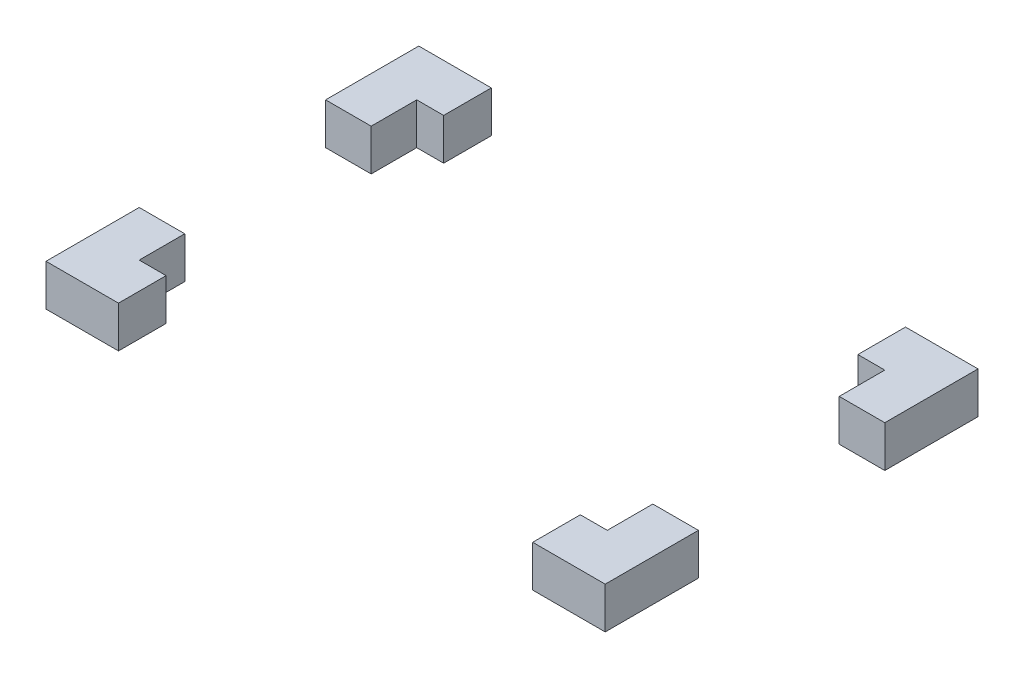
ISO-10303-21;
HEADER;
FILE_DESCRIPTION(('STEP AP214'),'2;1');
FILE_NAME('part.step','',(''),(''),'','','');
FILE_SCHEMA(('AUTOMOTIVE_DESIGN { 1 0 10303 214 1 1 1 1 }'));
ENDSEC;
DATA;
#1=APPLICATION_CONTEXT('core data for automotive mechanical design processes');
#2=APPLICATION_PROTOCOL_DEFINITION('international standard','automotive_design',2000,#1);
#3=PRODUCT_CONTEXT('',#1,'mechanical');
#4=PRODUCT('Part','Part','',(#3));
#5=PRODUCT_RELATED_PRODUCT_CATEGORY('part','',(#4));
#6=PRODUCT_DEFINITION_FORMATION('','',#4);
#7=PRODUCT_DEFINITION_CONTEXT('part definition',#1,'design');
#8=PRODUCT_DEFINITION('design','',#6,#7);
#9=PRODUCT_DEFINITION_SHAPE('','',#8);
#10=(LENGTH_UNIT() NAMED_UNIT(*) SI_UNIT(.MILLI.,.METRE.));
#11=(NAMED_UNIT(*) PLANE_ANGLE_UNIT() SI_UNIT($,.RADIAN.));
#12=(NAMED_UNIT(*) SI_UNIT($,.STERADIAN.) SOLID_ANGLE_UNIT());
#13=UNCERTAINTY_MEASURE_WITH_UNIT(LENGTH_MEASURE(1.E-05),#10,'distance_accuracy_value','');
#14=(GEOMETRIC_REPRESENTATION_CONTEXT(3) GLOBAL_UNCERTAINTY_ASSIGNED_CONTEXT((#13)) GLOBAL_UNIT_ASSIGNED_CONTEXT((#10,
#11,#12)) REPRESENTATION_CONTEXT('',''));
#15=CARTESIAN_POINT('',(0.,0.,0.));
#16=DIRECTION('',(0.,0.,1.));
#17=DIRECTION('',(1.,0.,0.));
#18=AXIS2_PLACEMENT_3D('',#15,#16,#17);
#19=CARTESIAN_POINT('',(-67.5,10.,45.));
#20=DIRECTION('',(0.,0.,-1.));
#21=DIRECTION('',(-1.,0.,0.));
#22=AXIS2_PLACEMENT_3D('',#19,#20,#21);
#23=PLANE('',#22);
#24=DIRECTION('',(1.,0.,0.));
#25=VECTOR('',#24,1.);
#26=CARTESIAN_POINT('',(-67.5,0.,45.));
#27=LINE('',#26,#25);
#28=CARTESIAN_POINT('',(-67.5,0.,45.));
#29=VERTEX_POINT('',#28);
#30=CARTESIAN_POINT('',(-50.,0.,45.));
#31=VERTEX_POINT('',#30);
#32=EDGE_CURVE('E110',#29,#31,#27,.T.);
#33=ORIENTED_EDGE('',*,*,#32,.T.);
#34=DIRECTION('',(0.,1.,0.));
#35=VECTOR('',#34,1.);
#36=CARTESIAN_POINT('',(-50.,10.,45.));
#37=LINE('',#36,#35);
#38=CARTESIAN_POINT('',(-50.,10.,45.));
#39=VERTEX_POINT('',#38);
#40=EDGE_CURVE('E98',#31,#39,#37,.T.);
#41=ORIENTED_EDGE('',*,*,#40,.T.);
#42=DIRECTION('',(1.,0.,0.));
#43=VECTOR('',#42,1.);
#44=CARTESIAN_POINT('',(-67.5,10.,45.));
#45=LINE('',#44,#43);
#46=CARTESIAN_POINT('',(-67.5,10.,45.));
#47=VERTEX_POINT('',#46);
#48=EDGE_CURVE('E107',#47,#39,#45,.T.);
#49=ORIENTED_EDGE('',*,*,#48,.F.);
#50=DIRECTION('',(0.,-1.,0.));
#51=VECTOR('',#50,1.);
#52=CARTESIAN_POINT('',(-67.5,10.,45.));
#53=LINE('',#52,#51);
#54=EDGE_CURVE('E111',#47,#29,#53,.T.);
#55=ORIENTED_EDGE('',*,*,#54,.T.);
#56=EDGE_LOOP('',(#33,#41,#49,#55));
#57=FACE_BOUND('',#56,.T.);
#58=ADVANCED_FACE('F49',(#57),#23,.F.);
#59=CARTESIAN_POINT('',(-56.5,10.,33.5));
#60=DIRECTION('',(0.,0.,-1.));
#61=DIRECTION('',(-1.,0.,0.));
#62=AXIS2_PLACEMENT_3D('',#59,#60,#61);
#63=PLANE('',#62);
#64=DIRECTION('',(0.,1.,0.));
#65=VECTOR('',#64,1.);
#66=CARTESIAN_POINT('',(-50.,10.,33.5));
#67=LINE('',#66,#65);
#68=CARTESIAN_POINT('',(-50.,0.,33.5));
#69=VERTEX_POINT('',#68);
#70=CARTESIAN_POINT('',(-50.,10.,33.5));
#71=VERTEX_POINT('',#70);
#72=EDGE_CURVE('E58',#69,#71,#67,.T.);
#73=ORIENTED_EDGE('',*,*,#72,.F.);
#74=DIRECTION('',(1.,0.,0.));
#75=VECTOR('',#74,1.);
#76=CARTESIAN_POINT('',(-56.5,0.,33.5));
#77=LINE('',#76,#75);
#78=CARTESIAN_POINT('',(-56.5,0.,33.5));
#79=VERTEX_POINT('',#78);
#80=EDGE_CURVE('E128',#79,#69,#77,.T.);
#81=ORIENTED_EDGE('',*,*,#80,.F.);
#82=DIRECTION('',(0.,-1.,0.));
#83=VECTOR('',#82,1.);
#84=CARTESIAN_POINT('',(-56.5,10.,33.5));
#85=LINE('',#84,#83);
#86=CARTESIAN_POINT('',(-56.5,10.,33.5));
#87=VERTEX_POINT('',#86);
#88=EDGE_CURVE('E119',#87,#79,#85,.T.);
#89=ORIENTED_EDGE('',*,*,#88,.F.);
#90=DIRECTION('',(1.,0.,0.));
#91=VECTOR('',#90,1.);
#92=CARTESIAN_POINT('',(-56.5,10.,33.5));
#93=LINE('',#92,#91);
#94=EDGE_CURVE('E126',#87,#71,#93,.T.);
#95=ORIENTED_EDGE('',*,*,#94,.T.);
#96=EDGE_LOOP('',(#73,#81,#89,#95));
#97=FACE_BOUND('',#96,.T.);
#98=ADVANCED_FACE('F157',(#97),#63,.T.);
#99=CARTESIAN_POINT('',(0.,0.,0.));
#100=DIRECTION('',(0.,1.,0.));
#101=DIRECTION('',(0.,0.,1.));
#102=AXIS2_PLACEMENT_3D('',#99,#100,#101);
#103=PLANE('',#102);
#104=ORIENTED_EDGE('',*,*,#80,.T.);
#105=DIRECTION('',(0.,0.,1.));
#106=VECTOR('',#105,1.);
#107=CARTESIAN_POINT('',(-50.,0.,0.));
#108=LINE('',#107,#106);
#109=EDGE_CURVE('E66',#69,#31,#108,.T.);
#110=ORIENTED_EDGE('',*,*,#109,.T.);
#111=ORIENTED_EDGE('',*,*,#32,.F.);
#112=DIRECTION('',(0.,0.,1.));
#113=VECTOR('',#112,1.);
#114=CARTESIAN_POINT('',(-67.5,0.,-45.));
#115=LINE('',#114,#113);
#116=CARTESIAN_POINT('',(-67.5,0.,22.5));
#117=VERTEX_POINT('',#116);
#118=EDGE_CURVE('E132',#117,#29,#115,.T.);
#119=ORIENTED_EDGE('',*,*,#118,.F.);
#120=DIRECTION('',(1.,0.,0.));
#121=VECTOR('',#120,1.);
#122=CARTESIAN_POINT('',(0.,0.,22.5));
#123=LINE('',#122,#121);
#124=CARTESIAN_POINT('',(-56.5,0.,22.5));
#125=VERTEX_POINT('',#124);
#126=EDGE_CURVE('E52',#117,#125,#123,.T.);
#127=ORIENTED_EDGE('',*,*,#126,.T.);
#128=DIRECTION('',(0.,0.,1.));
#129=VECTOR('',#128,1.);
#130=CARTESIAN_POINT('',(-56.5,0.,-33.5));
#131=LINE('',#130,#129);
#132=EDGE_CURVE('E121',#125,#79,#131,.T.);
#133=ORIENTED_EDGE('',*,*,#132,.T.);
#134=EDGE_LOOP('',(#104,#110,#111,#119,#127,#133));
#135=FACE_BOUND('',#134,.T.);
#136=ADVANCED_FACE('F150',(#135),#103,.F.);
#137=CARTESIAN_POINT('',(0.,10.,0.));
#138=DIRECTION('',(0.,1.,0.));
#139=DIRECTION('',(0.,0.,1.));
#140=AXIS2_PLACEMENT_3D('',#137,#138,#139);
#141=PLANE('',#140);
#142=DIRECTION('',(0.,0.,1.));
#143=VECTOR('',#142,1.);
#144=CARTESIAN_POINT('',(-50.,10.,0.));
#145=LINE('',#144,#143);
#146=EDGE_CURVE('E12',#71,#39,#145,.T.);
#147=ORIENTED_EDGE('',*,*,#146,.F.);
#148=ORIENTED_EDGE('',*,*,#94,.F.);
#149=DIRECTION('',(0.,0.,1.));
#150=VECTOR('',#149,1.);
#151=CARTESIAN_POINT('',(-56.5,10.,-33.5));
#152=LINE('',#151,#150);
#153=CARTESIAN_POINT('',(-56.5,10.,22.5));
#154=VERTEX_POINT('',#153);
#155=EDGE_CURVE('E117',#154,#87,#152,.T.);
#156=ORIENTED_EDGE('',*,*,#155,.F.);
#157=DIRECTION('',(1.,0.,0.));
#158=VECTOR('',#157,1.);
#159=CARTESIAN_POINT('',(0.,10.,22.5));
#160=LINE('',#159,#158);
#161=CARTESIAN_POINT('',(-67.5,10.,22.5));
#162=VERTEX_POINT('',#161);
#163=EDGE_CURVE('E130',#162,#154,#160,.T.);
#164=ORIENTED_EDGE('',*,*,#163,.F.);
#165=DIRECTION('',(0.,0.,1.));
#166=VECTOR('',#165,1.);
#167=CARTESIAN_POINT('',(-67.5,10.,-45.));
#168=LINE('',#167,#166);
#169=EDGE_CURVE('E116',#162,#47,#168,.T.);
#170=ORIENTED_EDGE('',*,*,#169,.T.);
#171=ORIENTED_EDGE('',*,*,#48,.T.);
#172=EDGE_LOOP('',(#147,#148,#156,#164,#170,#171));
#173=FACE_BOUND('',#172,.T.);
#174=ADVANCED_FACE('F113',(#173),#141,.T.);
#175=CARTESIAN_POINT('',(-56.5,10.,-33.5));
#176=DIRECTION('',(1.,0.,0.));
#177=DIRECTION('',(0.,0.,-1.));
#178=AXIS2_PLACEMENT_3D('',#175,#176,#177);
#179=PLANE('',#178);
#180=DIRECTION('',(0.,-1.,0.));
#181=VECTOR('',#180,1.);
#182=CARTESIAN_POINT('',(-56.5,10.,22.5));
#183=LINE('',#182,#181);
#184=EDGE_CURVE('E131',#154,#125,#183,.T.);
#185=ORIENTED_EDGE('',*,*,#184,.F.);
#186=ORIENTED_EDGE('',*,*,#155,.T.);
#187=ORIENTED_EDGE('',*,*,#88,.T.);
#188=ORIENTED_EDGE('',*,*,#132,.F.);
#189=EDGE_LOOP('',(#185,#186,#187,#188));
#190=FACE_BOUND('',#189,.T.);
#191=ADVANCED_FACE('F153',(#190),#179,.T.);
#192=CARTESIAN_POINT('',(-67.5,10.,-45.));
#193=DIRECTION('',(1.,0.,0.));
#194=DIRECTION('',(0.,0.,-1.));
#195=AXIS2_PLACEMENT_3D('',#192,#193,#194);
#196=PLANE('',#195);
#197=ORIENTED_EDGE('',*,*,#169,.F.);
#198=DIRECTION('',(0.,-1.,0.));
#199=VECTOR('',#198,1.);
#200=CARTESIAN_POINT('',(-67.5,10.,22.5));
#201=LINE('',#200,#199);
#202=EDGE_CURVE('E136',#162,#117,#201,.T.);
#203=ORIENTED_EDGE('',*,*,#202,.T.);
#204=ORIENTED_EDGE('',*,*,#118,.T.);
#205=ORIENTED_EDGE('',*,*,#54,.F.);
#206=EDGE_LOOP('',(#197,#203,#204,#205));
#207=FACE_BOUND('',#206,.T.);
#208=ADVANCED_FACE('F158',(#207),#196,.F.);
#209=CARTESIAN_POINT('',(356.5,15.,22.5));
#210=DIRECTION('',(0.,0.,1.));
#211=DIRECTION('',(0.,-1.,0.));
#212=AXIS2_PLACEMENT_3D('',#209,#210,#211);
#213=PLANE('',#212);
#214=ORIENTED_EDGE('',*,*,#163,.T.);
#215=ORIENTED_EDGE('',*,*,#184,.T.);
#216=ORIENTED_EDGE('',*,*,#126,.F.);
#217=ORIENTED_EDGE('',*,*,#202,.F.);
#218=EDGE_LOOP('',(#214,#215,#216,#217));
#219=FACE_BOUND('',#218,.T.);
#220=ADVANCED_FACE('F159',(#219),#213,.F.);
#221=CARTESIAN_POINT('',(-50.,-15.,-58.8496360731405));
#222=DIRECTION('',(-1.,0.,0.));
#223=DIRECTION('',(0.,0.,1.));
#224=AXIS2_PLACEMENT_3D('',#221,#222,#223);
#225=PLANE('',#224);
#226=ORIENTED_EDGE('',*,*,#72,.T.);
#227=ORIENTED_EDGE('',*,*,#146,.T.);
#228=ORIENTED_EDGE('',*,*,#40,.F.);
#229=ORIENTED_EDGE('',*,*,#109,.F.);
#230=EDGE_LOOP('',(#226,#227,#228,#229));
#231=FACE_BOUND('',#230,.T.);
#232=ADVANCED_FACE('F97',(#231),#225,.F.);
#233=CLOSED_SHELL('',(#58,#98,#136,#174,#191,#208,#220,#232));
#234=MANIFOLD_SOLID_BREP('B2',#233);
#235=CARTESIAN_POINT('',(0.,10.,0.));
#236=DIRECTION('',(0.,1.,0.));
#237=DIRECTION('',(0.,0.,1.));
#238=AXIS2_PLACEMENT_3D('',#235,#236,#237);
#239=PLANE('',#238);
#240=DIRECTION('',(0.,0.,1.));
#241=VECTOR('',#240,1.);
#242=CARTESIAN_POINT('',(-50.,10.,0.));
#243=LINE('',#242,#241);
#244=CARTESIAN_POINT('',(-50.,10.,-45.));
#245=VERTEX_POINT('',#244);
#246=CARTESIAN_POINT('',(-50.,10.,-33.5));
#247=VERTEX_POINT('',#246);
#248=EDGE_CURVE('E243',#245,#247,#243,.T.);
#249=ORIENTED_EDGE('',*,*,#248,.F.);
#250=DIRECTION('',(-1.,0.,0.));
#251=VECTOR('',#250,1.);
#252=CARTESIAN_POINT('',(-67.5,10.,-45.));
#253=LINE('',#252,#251);
#254=CARTESIAN_POINT('',(-67.5,10.,-45.));
#255=VERTEX_POINT('',#254);
#256=EDGE_CURVE('E237',#245,#255,#253,.T.);
#257=ORIENTED_EDGE('',*,*,#256,.T.);
#258=DIRECTION('',(0.,0.,1.));
#259=VECTOR('',#258,1.);
#260=CARTESIAN_POINT('',(-67.5,10.,-45.));
#261=LINE('',#260,#259);
#262=CARTESIAN_POINT('',(-67.5,10.,-22.5));
#263=VERTEX_POINT('',#262);
#264=EDGE_CURVE('E295',#255,#263,#261,.T.);
#265=ORIENTED_EDGE('',*,*,#264,.T.);
#266=DIRECTION('',(-1.,0.,0.));
#267=VECTOR('',#266,1.);
#268=CARTESIAN_POINT('',(0.,10.,-22.5));
#269=LINE('',#268,#267);
#270=CARTESIAN_POINT('',(-56.5,10.,-22.5));
#271=VERTEX_POINT('',#270);
#272=EDGE_CURVE('E317',#271,#263,#269,.T.);
#273=ORIENTED_EDGE('',*,*,#272,.F.);
#274=DIRECTION('',(0.,0.,1.));
#275=VECTOR('',#274,1.);
#276=CARTESIAN_POINT('',(-56.5,10.,-33.5));
#277=LINE('',#276,#275);
#278=CARTESIAN_POINT('',(-56.5,10.,-33.5));
#279=VERTEX_POINT('',#278);
#280=EDGE_CURVE('E327',#279,#271,#277,.T.);
#281=ORIENTED_EDGE('',*,*,#280,.F.);
#282=DIRECTION('',(-1.,0.,0.));
#283=VECTOR('',#282,1.);
#284=CARTESIAN_POINT('',(-56.5,10.,-33.5));
#285=LINE('',#284,#283);
#286=EDGE_CURVE('E312',#247,#279,#285,.T.);
#287=ORIENTED_EDGE('',*,*,#286,.F.);
#288=EDGE_LOOP('',(#249,#257,#265,#273,#281,#287));
#289=FACE_BOUND('',#288,.T.);
#290=ADVANCED_FACE('F234',(#289),#239,.T.);
#291=CARTESIAN_POINT('',(0.,0.,0.));
#292=DIRECTION('',(0.,1.,0.));
#293=DIRECTION('',(0.,0.,1.));
#294=AXIS2_PLACEMENT_3D('',#291,#292,#293);
#295=PLANE('',#294);
#296=DIRECTION('',(-1.,0.,0.));
#297=VECTOR('',#296,1.);
#298=CARTESIAN_POINT('',(-67.5,0.,-45.));
#299=LINE('',#298,#297);
#300=CARTESIAN_POINT('',(-50.,0.,-45.));
#301=VERTEX_POINT('',#300);
#302=CARTESIAN_POINT('',(-67.5,0.,-45.));
#303=VERTEX_POINT('',#302);
#304=EDGE_CURVE('E294',#301,#303,#299,.T.);
#305=ORIENTED_EDGE('',*,*,#304,.F.);
#306=DIRECTION('',(0.,0.,1.));
#307=VECTOR('',#306,1.);
#308=CARTESIAN_POINT('',(-50.,0.,0.));
#309=LINE('',#308,#307);
#310=CARTESIAN_POINT('',(-50.,0.,-33.5));
#311=VERTEX_POINT('',#310);
#312=EDGE_CURVE('E283',#301,#311,#309,.T.);
#313=ORIENTED_EDGE('',*,*,#312,.T.);
#314=DIRECTION('',(-1.,0.,0.));
#315=VECTOR('',#314,1.);
#316=CARTESIAN_POINT('',(-56.5,0.,-33.5));
#317=LINE('',#316,#315);
#318=CARTESIAN_POINT('',(-56.5,0.,-33.5));
#319=VERTEX_POINT('',#318);
#320=EDGE_CURVE('E291',#311,#319,#317,.T.);
#321=ORIENTED_EDGE('',*,*,#320,.T.);
#322=DIRECTION('',(0.,0.,1.));
#323=VECTOR('',#322,1.);
#324=CARTESIAN_POINT('',(-56.5,0.,-33.5));
#325=LINE('',#324,#323);
#326=CARTESIAN_POINT('',(-56.5,0.,-22.5));
#327=VERTEX_POINT('',#326);
#328=EDGE_CURVE('E301',#319,#327,#325,.T.);
#329=ORIENTED_EDGE('',*,*,#328,.T.);
#330=DIRECTION('',(-1.,0.,0.));
#331=VECTOR('',#330,1.);
#332=CARTESIAN_POINT('',(0.,0.,-22.5));
#333=LINE('',#332,#331);
#334=CARTESIAN_POINT('',(-67.5,0.,-22.5));
#335=VERTEX_POINT('',#334);
#336=EDGE_CURVE('E303',#327,#335,#333,.T.);
#337=ORIENTED_EDGE('',*,*,#336,.T.);
#338=DIRECTION('',(0.,0.,1.));
#339=VECTOR('',#338,1.);
#340=CARTESIAN_POINT('',(-67.5,0.,-45.));
#341=LINE('',#340,#339);
#342=EDGE_CURVE('E320',#303,#335,#341,.T.);
#343=ORIENTED_EDGE('',*,*,#342,.F.);
#344=EDGE_LOOP('',(#305,#313,#321,#329,#337,#343));
#345=FACE_BOUND('',#344,.T.);
#346=ADVANCED_FACE('F289',(#345),#295,.F.);
#347=CARTESIAN_POINT('',(-67.5,10.,-45.));
#348=DIRECTION('',(0.,0.,1.));
#349=DIRECTION('',(1.,0.,0.));
#350=AXIS2_PLACEMENT_3D('',#347,#348,#349);
#351=PLANE('',#350);
#352=ORIENTED_EDGE('',*,*,#256,.F.);
#353=DIRECTION('',(0.,-1.,0.));
#354=VECTOR('',#353,1.);
#355=CARTESIAN_POINT('',(-50.,10.,-45.));
#356=LINE('',#355,#354);
#357=EDGE_CURVE('E252',#245,#301,#356,.T.);
#358=ORIENTED_EDGE('',*,*,#357,.T.);
#359=ORIENTED_EDGE('',*,*,#304,.T.);
#360=DIRECTION('',(0.,-1.,0.));
#361=VECTOR('',#360,1.);
#362=CARTESIAN_POINT('',(-67.5,10.,-45.));
#363=LINE('',#362,#361);
#364=EDGE_CURVE('E315',#255,#303,#363,.T.);
#365=ORIENTED_EDGE('',*,*,#364,.F.);
#366=EDGE_LOOP('',(#352,#358,#359,#365));
#367=FACE_BOUND('',#366,.T.);
#368=ADVANCED_FACE('F339',(#367),#351,.F.);
#369=CARTESIAN_POINT('',(-56.5,10.,-33.5));
#370=DIRECTION('',(0.,0.,1.));
#371=DIRECTION('',(1.,0.,0.));
#372=AXIS2_PLACEMENT_3D('',#369,#370,#371);
#373=PLANE('',#372);
#374=DIRECTION('',(0.,-1.,0.));
#375=VECTOR('',#374,1.);
#376=CARTESIAN_POINT('',(-50.,10.,-33.5));
#377=LINE('',#376,#375);
#378=EDGE_CURVE('E47',#247,#311,#377,.T.);
#379=ORIENTED_EDGE('',*,*,#378,.F.);
#380=ORIENTED_EDGE('',*,*,#286,.T.);
#381=DIRECTION('',(0.,-1.,0.));
#382=VECTOR('',#381,1.);
#383=CARTESIAN_POINT('',(-56.5,10.,-33.5));
#384=LINE('',#383,#382);
#385=EDGE_CURVE('E300',#279,#319,#384,.T.);
#386=ORIENTED_EDGE('',*,*,#385,.T.);
#387=ORIENTED_EDGE('',*,*,#320,.F.);
#388=EDGE_LOOP('',(#379,#380,#386,#387));
#389=FACE_BOUND('',#388,.T.);
#390=ADVANCED_FACE('F298',(#389),#373,.T.);
#391=CARTESIAN_POINT('',(-67.5,10.,-45.));
#392=DIRECTION('',(1.,0.,0.));
#393=DIRECTION('',(0.,0.,-1.));
#394=AXIS2_PLACEMENT_3D('',#391,#392,#393);
#395=PLANE('',#394);
#396=ORIENTED_EDGE('',*,*,#342,.T.);
#397=DIRECTION('',(0.,1.,0.));
#398=VECTOR('',#397,1.);
#399=CARTESIAN_POINT('',(-67.5,10.,-22.5));
#400=LINE('',#399,#398);
#401=EDGE_CURVE('E321',#335,#263,#400,.T.);
#402=ORIENTED_EDGE('',*,*,#401,.T.);
#403=ORIENTED_EDGE('',*,*,#264,.F.);
#404=ORIENTED_EDGE('',*,*,#364,.T.);
#405=EDGE_LOOP('',(#396,#402,#403,#404));
#406=FACE_BOUND('',#405,.T.);
#407=ADVANCED_FACE('F338',(#406),#395,.F.);
#408=CARTESIAN_POINT('',(-56.5,10.,-33.5));
#409=DIRECTION('',(1.,0.,0.));
#410=DIRECTION('',(0.,0.,-1.));
#411=AXIS2_PLACEMENT_3D('',#408,#409,#410);
#412=PLANE('',#411);
#413=DIRECTION('',(0.,1.,0.));
#414=VECTOR('',#413,1.);
#415=CARTESIAN_POINT('',(-56.5,10.,-22.5));
#416=LINE('',#415,#414);
#417=EDGE_CURVE('E319',#327,#271,#416,.T.);
#418=ORIENTED_EDGE('',*,*,#417,.F.);
#419=ORIENTED_EDGE('',*,*,#328,.F.);
#420=ORIENTED_EDGE('',*,*,#385,.F.);
#421=ORIENTED_EDGE('',*,*,#280,.T.);
#422=EDGE_LOOP('',(#418,#419,#420,#421));
#423=FACE_BOUND('',#422,.T.);
#424=ADVANCED_FACE('F344',(#423),#412,.T.);
#425=CARTESIAN_POINT('',(356.5,15.,-22.5));
#426=DIRECTION('',(0.,0.,-1.));
#427=DIRECTION('',(0.,1.,0.));
#428=AXIS2_PLACEMENT_3D('',#425,#426,#427);
#429=PLANE('',#428);
#430=ORIENTED_EDGE('',*,*,#336,.F.);
#431=ORIENTED_EDGE('',*,*,#417,.T.);
#432=ORIENTED_EDGE('',*,*,#272,.T.);
#433=ORIENTED_EDGE('',*,*,#401,.F.);
#434=EDGE_LOOP('',(#430,#431,#432,#433));
#435=FACE_BOUND('',#434,.T.);
#436=ADVANCED_FACE('F343',(#435),#429,.F.);
#437=CARTESIAN_POINT('',(-50.,-15.,-58.8496360731405));
#438=DIRECTION('',(-1.,0.,0.));
#439=DIRECTION('',(0.,0.,1.));
#440=AXIS2_PLACEMENT_3D('',#437,#438,#439);
#441=PLANE('',#440);
#442=ORIENTED_EDGE('',*,*,#248,.T.);
#443=ORIENTED_EDGE('',*,*,#378,.T.);
#444=ORIENTED_EDGE('',*,*,#312,.F.);
#445=ORIENTED_EDGE('',*,*,#357,.F.);
#446=EDGE_LOOP('',(#442,#443,#444,#445));
#447=FACE_BOUND('',#446,.T.);
#448=ADVANCED_FACE('F282',(#447),#441,.F.);
#449=CLOSED_SHELL('',(#290,#346,#368,#390,#407,#424,#436,#448));
#450=MANIFOLD_SOLID_BREP('B6',#449);
#451=CARTESIAN_POINT('',(356.5,15.,-22.5));
#452=DIRECTION('',(0.,0.,-1.));
#453=DIRECTION('',(0.,1.,0.));
#454=AXIS2_PLACEMENT_3D('',#451,#452,#453);
#455=PLANE('',#454);
#456=DIRECTION('',(-1.,0.,0.));
#457=VECTOR('',#456,1.);
#458=CARTESIAN_POINT('',(0.,10.,-22.5));
#459=LINE('',#458,#457);
#460=CARTESIAN_POINT('',(67.5,10.,-22.5));
#461=VERTEX_POINT('',#460);
#462=CARTESIAN_POINT('',(56.5,10.,-22.5));
#463=VERTEX_POINT('',#462);
#464=EDGE_CURVE('E454',#461,#463,#459,.T.);
#465=ORIENTED_EDGE('',*,*,#464,.T.);
#466=DIRECTION('',(0.,-1.,0.));
#467=VECTOR('',#466,1.);
#468=CARTESIAN_POINT('',(56.5,10.,-22.5));
#469=LINE('',#468,#467);
#470=CARTESIAN_POINT('',(56.5,0.,-22.5));
#471=VERTEX_POINT('',#470);
#472=EDGE_CURVE('E426',#463,#471,#469,.T.);
#473=ORIENTED_EDGE('',*,*,#472,.T.);
#474=DIRECTION('',(-1.,0.,0.));
#475=VECTOR('',#474,1.);
#476=CARTESIAN_POINT('',(0.,0.,-22.5));
#477=LINE('',#476,#475);
#478=CARTESIAN_POINT('',(67.5,0.,-22.5));
#479=VERTEX_POINT('',#478);
#480=EDGE_CURVE('E506',#479,#471,#477,.T.);
#481=ORIENTED_EDGE('',*,*,#480,.F.);
#482=DIRECTION('',(0.,-1.,0.));
#483=VECTOR('',#482,1.);
#484=CARTESIAN_POINT('',(67.5,10.,-22.5));
#485=LINE('',#484,#483);
#486=EDGE_CURVE('E441',#461,#479,#485,.T.);
#487=ORIENTED_EDGE('',*,*,#486,.F.);
#488=EDGE_LOOP('',(#465,#473,#481,#487));
#489=FACE_BOUND('',#488,.T.);
#490=ADVANCED_FACE('F418',(#489),#455,.F.);
#491=CARTESIAN_POINT('',(67.5,10.,-45.));
#492=DIRECTION('',(-1.,0.,0.));
#493=DIRECTION('',(0.,0.,1.));
#494=AXIS2_PLACEMENT_3D('',#491,#492,#493);
#495=PLANE('',#494);
#496=DIRECTION('',(0.,0.,-1.));
#497=VECTOR('',#496,1.);
#498=CARTESIAN_POINT('',(67.5,10.,-45.));
#499=LINE('',#498,#497);
#500=CARTESIAN_POINT('',(67.5,10.,-45.));
#501=VERTEX_POINT('',#500);
#502=EDGE_CURVE('E468',#461,#501,#499,.T.);
#503=ORIENTED_EDGE('',*,*,#502,.F.);
#504=ORIENTED_EDGE('',*,*,#486,.T.);
#505=DIRECTION('',(0.,0.,-1.));
#506=VECTOR('',#505,1.);
#507=CARTESIAN_POINT('',(67.5,0.,-45.));
#508=LINE('',#507,#506);
#509=CARTESIAN_POINT('',(67.5,0.,-45.));
#510=VERTEX_POINT('',#509);
#511=EDGE_CURVE('E504',#479,#510,#508,.T.);
#512=ORIENTED_EDGE('',*,*,#511,.T.);
#513=DIRECTION('',(0.,-1.,0.));
#514=VECTOR('',#513,1.);
#515=CARTESIAN_POINT('',(67.5,10.,-45.));
#516=LINE('',#515,#514);
#517=EDGE_CURVE('E494',#501,#510,#516,.T.);
#518=ORIENTED_EDGE('',*,*,#517,.F.);
#519=EDGE_LOOP('',(#503,#504,#512,#518));
#520=FACE_BOUND('',#519,.T.);
#521=ADVANCED_FACE('F528',(#520),#495,.F.);
#522=CARTESIAN_POINT('',(56.5,10.,-33.5));
#523=DIRECTION('',(-1.,0.,0.));
#524=DIRECTION('',(0.,0.,1.));
#525=AXIS2_PLACEMENT_3D('',#522,#523,#524);
#526=PLANE('',#525);
#527=ORIENTED_EDGE('',*,*,#472,.F.);
#528=DIRECTION('',(0.,0.,-1.));
#529=VECTOR('',#528,1.);
#530=CARTESIAN_POINT('',(56.5,10.,-33.5));
#531=LINE('',#530,#529);
#532=CARTESIAN_POINT('',(56.5,10.,-33.5));
#533=VERTEX_POINT('',#532);
#534=EDGE_CURVE('E511',#463,#533,#531,.T.);
#535=ORIENTED_EDGE('',*,*,#534,.T.);
#536=DIRECTION('',(0.,-1.,0.));
#537=VECTOR('',#536,1.);
#538=CARTESIAN_POINT('',(56.5,10.,-33.5));
#539=LINE('',#538,#537);
#540=CARTESIAN_POINT('',(56.5,0.,-33.5));
#541=VERTEX_POINT('',#540);
#542=EDGE_CURVE('E493',#533,#541,#539,.T.);
#543=ORIENTED_EDGE('',*,*,#542,.T.);
#544=DIRECTION('',(0.,0.,-1.));
#545=VECTOR('',#544,1.);
#546=CARTESIAN_POINT('',(56.5,0.,-33.5));
#547=LINE('',#546,#545);
#548=EDGE_CURVE('E508',#471,#541,#547,.T.);
#549=ORIENTED_EDGE('',*,*,#548,.F.);
#550=EDGE_LOOP('',(#527,#535,#543,#549));
#551=FACE_BOUND('',#550,.T.);
#552=ADVANCED_FACE('F526',(#551),#526,.T.);
#553=CARTESIAN_POINT('',(-67.5,10.,-45.));
#554=DIRECTION('',(0.,0.,1.));
#555=DIRECTION('',(1.,0.,0.));
#556=AXIS2_PLACEMENT_3D('',#553,#554,#555);
#557=PLANE('',#556);
#558=DIRECTION('',(-1.,0.,0.));
#559=VECTOR('',#558,1.);
#560=CARTESIAN_POINT('',(-67.5,0.,-45.));
#561=LINE('',#560,#559);
#562=CARTESIAN_POINT('',(50.,0.,-45.));
#563=VERTEX_POINT('',#562);
#564=EDGE_CURVE('E498',#510,#563,#561,.T.);
#565=ORIENTED_EDGE('',*,*,#564,.T.);
#566=DIRECTION('',(0.,1.,0.));
#567=VECTOR('',#566,1.);
#568=CARTESIAN_POINT('',(50.,10.,-45.));
#569=LINE('',#568,#567);
#570=CARTESIAN_POINT('',(50.,10.,-45.));
#571=VERTEX_POINT('',#570);
#572=EDGE_CURVE('E477',#563,#571,#569,.T.);
#573=ORIENTED_EDGE('',*,*,#572,.T.);
#574=DIRECTION('',(-1.,0.,0.));
#575=VECTOR('',#574,1.);
#576=CARTESIAN_POINT('',(-67.5,10.,-45.));
#577=LINE('',#576,#575);
#578=EDGE_CURVE('E488',#501,#571,#577,.T.);
#579=ORIENTED_EDGE('',*,*,#578,.F.);
#580=ORIENTED_EDGE('',*,*,#517,.T.);
#581=EDGE_LOOP('',(#565,#573,#579,#580));
#582=FACE_BOUND('',#581,.T.);
#583=ADVANCED_FACE('F520',(#582),#557,.F.);
#584=CARTESIAN_POINT('',(-56.5,10.,-33.5));
#585=DIRECTION('',(0.,0.,1.));
#586=DIRECTION('',(1.,0.,0.));
#587=AXIS2_PLACEMENT_3D('',#584,#585,#586);
#588=PLANE('',#587);
#589=DIRECTION('',(0.,1.,0.));
#590=VECTOR('',#589,1.);
#591=CARTESIAN_POINT('',(50.,10.,-33.5));
#592=LINE('',#591,#590);
#593=CARTESIAN_POINT('',(50.,0.,-33.5));
#594=VERTEX_POINT('',#593);
#595=CARTESIAN_POINT('',(50.,10.,-33.5));
#596=VERTEX_POINT('',#595);
#597=EDGE_CURVE('E232',#594,#596,#592,.T.);
#598=ORIENTED_EDGE('',*,*,#597,.F.);
#599=DIRECTION('',(-1.,0.,0.));
#600=VECTOR('',#599,1.);
#601=CARTESIAN_POINT('',(-56.5,0.,-33.5));
#602=LINE('',#601,#600);
#603=EDGE_CURVE('E502',#541,#594,#602,.T.);
#604=ORIENTED_EDGE('',*,*,#603,.F.);
#605=ORIENTED_EDGE('',*,*,#542,.F.);
#606=DIRECTION('',(-1.,0.,0.));
#607=VECTOR('',#606,1.);
#608=CARTESIAN_POINT('',(-56.5,10.,-33.5));
#609=LINE('',#608,#607);
#610=EDGE_CURVE('E486',#533,#596,#609,.T.);
#611=ORIENTED_EDGE('',*,*,#610,.T.);
#612=EDGE_LOOP('',(#598,#604,#605,#611));
#613=FACE_BOUND('',#612,.T.);
#614=ADVANCED_FACE('F491',(#613),#588,.T.);
#615=CARTESIAN_POINT('',(0.,0.,0.));
#616=DIRECTION('',(0.,1.,0.));
#617=DIRECTION('',(0.,0.,1.));
#618=AXIS2_PLACEMENT_3D('',#615,#616,#617);
#619=PLANE('',#618);
#620=ORIENTED_EDGE('',*,*,#603,.T.);
#621=DIRECTION('',(0.,0.,-1.));
#622=VECTOR('',#621,1.);
#623=CARTESIAN_POINT('',(50.,0.,0.));
#624=LINE('',#623,#622);
#625=EDGE_CURVE('E432',#594,#563,#624,.T.);
#626=ORIENTED_EDGE('',*,*,#625,.T.);
#627=ORIENTED_EDGE('',*,*,#564,.F.);
#628=ORIENTED_EDGE('',*,*,#511,.F.);
#629=ORIENTED_EDGE('',*,*,#480,.T.);
#630=ORIENTED_EDGE('',*,*,#548,.T.);
#631=EDGE_LOOP('',(#620,#626,#627,#628,#629,#630));
#632=FACE_BOUND('',#631,.T.);
#633=ADVANCED_FACE('F514',(#632),#619,.F.);
#634=CARTESIAN_POINT('',(0.,10.,0.));
#635=DIRECTION('',(0.,1.,0.));
#636=DIRECTION('',(0.,0.,1.));
#637=AXIS2_PLACEMENT_3D('',#634,#635,#636);
#638=PLANE('',#637);
#639=DIRECTION('',(0.,0.,-1.));
#640=VECTOR('',#639,1.);
#641=CARTESIAN_POINT('',(50.,10.,0.));
#642=LINE('',#641,#640);
#643=EDGE_CURVE('E474',#596,#571,#642,.T.);
#644=ORIENTED_EDGE('',*,*,#643,.F.);
#645=ORIENTED_EDGE('',*,*,#610,.F.);
#646=ORIENTED_EDGE('',*,*,#534,.F.);
#647=ORIENTED_EDGE('',*,*,#464,.F.);
#648=ORIENTED_EDGE('',*,*,#502,.T.);
#649=ORIENTED_EDGE('',*,*,#578,.T.);
#650=EDGE_LOOP('',(#644,#645,#646,#647,#648,#649));
#651=FACE_BOUND('',#650,.T.);
#652=ADVANCED_FACE('F420',(#651),#638,.T.);
#653=CARTESIAN_POINT('',(50.,-15.,-58.8496360731405));
#654=DIRECTION('',(1.,0.,0.));
#655=DIRECTION('',(0.,0.,-1.));
#656=AXIS2_PLACEMENT_3D('',#653,#654,#655);
#657=PLANE('',#656);
#658=ORIENTED_EDGE('',*,*,#625,.F.);
#659=ORIENTED_EDGE('',*,*,#597,.T.);
#660=ORIENTED_EDGE('',*,*,#643,.T.);
#661=ORIENTED_EDGE('',*,*,#572,.F.);
#662=EDGE_LOOP('',(#658,#659,#660,#661));
#663=FACE_BOUND('',#662,.T.);
#664=ADVANCED_FACE('F479',(#663),#657,.F.);
#665=CLOSED_SHELL('',(#490,#521,#552,#583,#614,#633,#652,#664));
#666=MANIFOLD_SOLID_BREP('B41',#665);
#667=CARTESIAN_POINT('',(56.5,10.,-33.5));
#668=DIRECTION('',(-1.,0.,0.));
#669=DIRECTION('',(0.,0.,1.));
#670=AXIS2_PLACEMENT_3D('',#667,#668,#669);
#671=PLANE('',#670);
#672=DIRECTION('',(0.,1.,0.));
#673=VECTOR('',#672,1.);
#674=CARTESIAN_POINT('',(56.5,10.,22.5));
#675=LINE('',#674,#673);
#676=CARTESIAN_POINT('',(56.5,0.,22.5));
#677=VERTEX_POINT('',#676);
#678=CARTESIAN_POINT('',(56.5,10.,22.5));
#679=VERTEX_POINT('',#678);
#680=EDGE_CURVE('E601',#677,#679,#675,.T.);
#681=ORIENTED_EDGE('',*,*,#680,.F.);
#682=DIRECTION('',(0.,0.,-1.));
#683=VECTOR('',#682,1.);
#684=CARTESIAN_POINT('',(56.5,0.,-33.5));
#685=LINE('',#684,#683);
#686=CARTESIAN_POINT('',(56.5,0.,33.5));
#687=VERTEX_POINT('',#686);
#688=EDGE_CURVE('E662',#687,#677,#685,.T.);
#689=ORIENTED_EDGE('',*,*,#688,.F.);
#690=DIRECTION('',(0.,-1.,0.));
#691=VECTOR('',#690,1.);
#692=CARTESIAN_POINT('',(56.5,10.,33.5));
#693=LINE('',#692,#691);
#694=CARTESIAN_POINT('',(56.5,10.,33.5));
#695=VERTEX_POINT('',#694);
#696=EDGE_CURVE('E664',#695,#687,#693,.T.);
#697=ORIENTED_EDGE('',*,*,#696,.F.);
#698=DIRECTION('',(0.,0.,-1.));
#699=VECTOR('',#698,1.);
#700=CARTESIAN_POINT('',(56.5,10.,-33.5));
#701=LINE('',#700,#699);
#702=EDGE_CURVE('E661',#695,#679,#701,.T.);
#703=ORIENTED_EDGE('',*,*,#702,.T.);
#704=EDGE_LOOP('',(#681,#689,#697,#703));
#705=FACE_BOUND('',#704,.T.);
#706=ADVANCED_FACE('F593',(#705),#671,.T.);
#707=CARTESIAN_POINT('',(356.5,15.,22.5));
#708=DIRECTION('',(0.,0.,1.));
#709=DIRECTION('',(0.,-1.,0.));
#710=AXIS2_PLACEMENT_3D('',#707,#708,#709);
#711=PLANE('',#710);
#712=DIRECTION('',(1.,0.,0.));
#713=VECTOR('',#712,1.);
#714=CARTESIAN_POINT('',(0.,0.,22.5));
#715=LINE('',#714,#713);
#716=CARTESIAN_POINT('',(67.5,0.,22.5));
#717=VERTEX_POINT('',#716);
#718=EDGE_CURVE('E615',#677,#717,#715,.T.);
#719=ORIENTED_EDGE('',*,*,#718,.F.);
#720=ORIENTED_EDGE('',*,*,#680,.T.);
#721=DIRECTION('',(1.,0.,0.));
#722=VECTOR('',#721,1.);
#723=CARTESIAN_POINT('',(0.,10.,22.5));
#724=LINE('',#723,#722);
#725=CARTESIAN_POINT('',(67.5,10.,22.5));
#726=VERTEX_POINT('',#725);
#727=EDGE_CURVE('E687',#679,#726,#724,.T.);
#728=ORIENTED_EDGE('',*,*,#727,.T.);
#729=DIRECTION('',(0.,1.,0.));
#730=VECTOR('',#729,1.);
#731=CARTESIAN_POINT('',(67.5,10.,22.5));
#732=LINE('',#731,#730);
#733=EDGE_CURVE('E669',#717,#726,#732,.T.);
#734=ORIENTED_EDGE('',*,*,#733,.F.);
#735=EDGE_LOOP('',(#719,#720,#728,#734));
#736=FACE_BOUND('',#735,.T.);
#737=ADVANCED_FACE('F686',(#736),#711,.F.);
#738=CARTESIAN_POINT('',(67.5,10.,-45.));
#739=DIRECTION('',(-1.,0.,0.));
#740=DIRECTION('',(0.,0.,1.));
#741=AXIS2_PLACEMENT_3D('',#738,#739,#740);
#742=PLANE('',#741);
#743=DIRECTION('',(0.,0.,-1.));
#744=VECTOR('',#743,1.);
#745=CARTESIAN_POINT('',(67.5,0.,-45.));
#746=LINE('',#745,#744);
#747=CARTESIAN_POINT('',(67.5,0.,45.));
#748=VERTEX_POINT('',#747);
#749=EDGE_CURVE('E678',#748,#717,#746,.T.);
#750=ORIENTED_EDGE('',*,*,#749,.T.);
#751=ORIENTED_EDGE('',*,*,#733,.T.);
#752=DIRECTION('',(0.,0.,-1.));
#753=VECTOR('',#752,1.);
#754=CARTESIAN_POINT('',(67.5,10.,-45.));
#755=LINE('',#754,#753);
#756=CARTESIAN_POINT('',(67.5,10.,45.));
#757=VERTEX_POINT('',#756);
#758=EDGE_CURVE('E677',#757,#726,#755,.T.);
#759=ORIENTED_EDGE('',*,*,#758,.F.);
#760=DIRECTION('',(0.,-1.,0.));
#761=VECTOR('',#760,1.);
#762=CARTESIAN_POINT('',(67.5,10.,45.));
#763=LINE('',#762,#761);
#764=EDGE_CURVE('E681',#757,#748,#763,.T.);
#765=ORIENTED_EDGE('',*,*,#764,.T.);
#766=EDGE_LOOP('',(#750,#751,#759,#765));
#767=FACE_BOUND('',#766,.T.);
#768=ADVANCED_FACE('F703',(#767),#742,.F.);
#769=CARTESIAN_POINT('',(0.,0.,0.));
#770=DIRECTION('',(0.,1.,0.));
#771=DIRECTION('',(0.,0.,1.));
#772=AXIS2_PLACEMENT_3D('',#769,#770,#771);
#773=PLANE('',#772);
#774=DIRECTION('',(1.,0.,0.));
#775=VECTOR('',#774,1.);
#776=CARTESIAN_POINT('',(-67.5,0.,45.));
#777=LINE('',#776,#775);
#778=CARTESIAN_POINT('',(50.,0.,45.));
#779=VERTEX_POINT('',#778);
#780=EDGE_CURVE('E674',#779,#748,#777,.T.);
#781=ORIENTED_EDGE('',*,*,#780,.F.);
#782=DIRECTION('',(0.,0.,-1.));
#783=VECTOR('',#782,1.);
#784=CARTESIAN_POINT('',(50.,0.,0.));
#785=LINE('',#784,#783);
#786=CARTESIAN_POINT('',(50.,0.,33.5));
#787=VERTEX_POINT('',#786);
#788=EDGE_CURVE('E696',#779,#787,#785,.T.);
#789=ORIENTED_EDGE('',*,*,#788,.T.);
#790=DIRECTION('',(1.,0.,0.));
#791=VECTOR('',#790,1.);
#792=CARTESIAN_POINT('',(-56.5,0.,33.5));
#793=LINE('',#792,#791);
#794=EDGE_CURVE('E655',#787,#687,#793,.T.);
#795=ORIENTED_EDGE('',*,*,#794,.T.);
#796=ORIENTED_EDGE('',*,*,#688,.T.);
#797=ORIENTED_EDGE('',*,*,#718,.T.);
#798=ORIENTED_EDGE('',*,*,#749,.F.);
#799=EDGE_LOOP('',(#781,#789,#795,#796,#797,#798));
#800=FACE_BOUND('',#799,.T.);
#801=ADVANCED_FACE('F694',(#800),#773,.F.);
#802=CARTESIAN_POINT('',(0.,10.,0.));
#803=DIRECTION('',(0.,1.,0.));
#804=DIRECTION('',(0.,0.,1.));
#805=AXIS2_PLACEMENT_3D('',#802,#803,#804);
#806=PLANE('',#805);
#807=DIRECTION('',(0.,0.,-1.));
#808=VECTOR('',#807,1.);
#809=CARTESIAN_POINT('',(50.,10.,0.));
#810=LINE('',#809,#808);
#811=CARTESIAN_POINT('',(50.,10.,45.));
#812=VERTEX_POINT('',#811);
#813=CARTESIAN_POINT('',(50.,10.,33.5));
#814=VERTEX_POINT('',#813);
#815=EDGE_CURVE('E416',#812,#814,#810,.T.);
#816=ORIENTED_EDGE('',*,*,#815,.F.);
#817=DIRECTION('',(1.,0.,0.));
#818=VECTOR('',#817,1.);
#819=CARTESIAN_POINT('',(-67.5,10.,45.));
#820=LINE('',#819,#818);
#821=EDGE_CURVE('E675',#812,#757,#820,.T.);
#822=ORIENTED_EDGE('',*,*,#821,.T.);
#823=ORIENTED_EDGE('',*,*,#758,.T.);
#824=ORIENTED_EDGE('',*,*,#727,.F.);
#825=ORIENTED_EDGE('',*,*,#702,.F.);
#826=DIRECTION('',(1.,0.,0.));
#827=VECTOR('',#826,1.);
#828=CARTESIAN_POINT('',(-56.5,10.,33.5));
#829=LINE('',#828,#827);
#830=EDGE_CURVE('E653',#814,#695,#829,.T.);
#831=ORIENTED_EDGE('',*,*,#830,.F.);
#832=EDGE_LOOP('',(#816,#822,#823,#824,#825,#831));
#833=FACE_BOUND('',#832,.T.);
#834=ADVANCED_FACE('F658',(#833),#806,.T.);
#835=CARTESIAN_POINT('',(-56.5,10.,33.5));
#836=DIRECTION('',(0.,0.,-1.));
#837=DIRECTION('',(-1.,0.,0.));
#838=AXIS2_PLACEMENT_3D('',#835,#836,#837);
#839=PLANE('',#838);
#840=DIRECTION('',(0.,-1.,0.));
#841=VECTOR('',#840,1.);
#842=CARTESIAN_POINT('',(50.,10.,33.5));
#843=LINE('',#842,#841);
#844=EDGE_CURVE('E644',#814,#787,#843,.T.);
#845=ORIENTED_EDGE('',*,*,#844,.F.);
#846=ORIENTED_EDGE('',*,*,#830,.T.);
#847=ORIENTED_EDGE('',*,*,#696,.T.);
#848=ORIENTED_EDGE('',*,*,#794,.F.);
#849=EDGE_LOOP('',(#845,#846,#847,#848));
#850=FACE_BOUND('',#849,.T.);
#851=ADVANCED_FACE('F651',(#850),#839,.T.);
#852=CARTESIAN_POINT('',(-67.5,10.,45.));
#853=DIRECTION('',(0.,0.,-1.));
#854=DIRECTION('',(-1.,0.,0.));
#855=AXIS2_PLACEMENT_3D('',#852,#853,#854);
#856=PLANE('',#855);
#857=ORIENTED_EDGE('',*,*,#821,.F.);
#858=DIRECTION('',(0.,-1.,0.));
#859=VECTOR('',#858,1.);
#860=CARTESIAN_POINT('',(50.,10.,45.));
#861=LINE('',#860,#859);
#862=EDGE_CURVE('E607',#812,#779,#861,.T.);
#863=ORIENTED_EDGE('',*,*,#862,.T.);
#864=ORIENTED_EDGE('',*,*,#780,.T.);
#865=ORIENTED_EDGE('',*,*,#764,.F.);
#866=EDGE_LOOP('',(#857,#863,#864,#865));
#867=FACE_BOUND('',#866,.T.);
#868=ADVANCED_FACE('F595',(#867),#856,.F.);
#869=CARTESIAN_POINT('',(50.,-15.,-58.8496360731405));
#870=DIRECTION('',(1.,0.,0.));
#871=DIRECTION('',(0.,0.,-1.));
#872=AXIS2_PLACEMENT_3D('',#869,#870,#871);
#873=PLANE('',#872);
#874=ORIENTED_EDGE('',*,*,#862,.F.);
#875=ORIENTED_EDGE('',*,*,#815,.T.);
#876=ORIENTED_EDGE('',*,*,#844,.T.);
#877=ORIENTED_EDGE('',*,*,#788,.F.);
#878=EDGE_LOOP('',(#874,#875,#876,#877));
#879=FACE_BOUND('',#878,.T.);
#880=ADVANCED_FACE('F643',(#879),#873,.F.);
#881=CLOSED_SHELL('',(#706,#737,#768,#801,#834,#851,#868,#880));
#882=MANIFOLD_SOLID_BREP('B226',#881);
#883=ADVANCED_BREP_SHAPE_REPRESENTATION('',(#18,#234,#450,#666,#882),#14);
#884=SHAPE_DEFINITION_REPRESENTATION(#9,#883);
ENDSEC;
END-ISO-10303-21;
